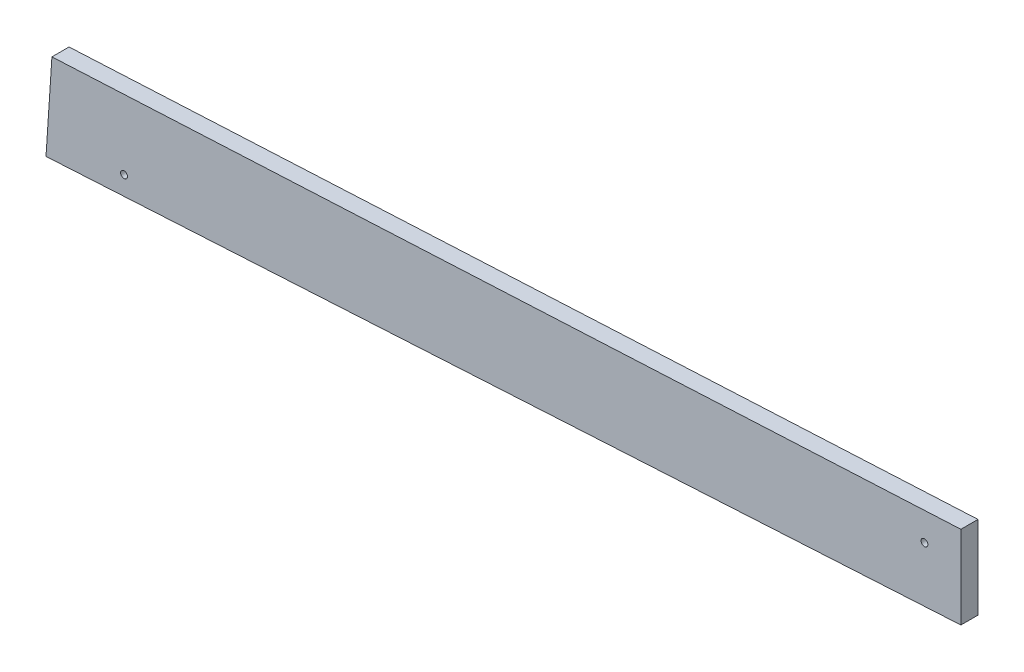
ISO-10303-21;
HEADER;
FILE_DESCRIPTION(('STEP AP214'),'2;1');
FILE_NAME('part.step','',(''),(''),'','','');
FILE_SCHEMA(('AUTOMOTIVE_DESIGN { 1 0 10303 214 1 1 1 1 }'));
ENDSEC;
DATA;
#1=APPLICATION_CONTEXT('core data for automotive mechanical design processes');
#2=APPLICATION_PROTOCOL_DEFINITION('international standard','automotive_design',2000,#1);
#3=PRODUCT_CONTEXT('',#1,'mechanical');
#4=PRODUCT('Part','Part','',(#3));
#5=PRODUCT_RELATED_PRODUCT_CATEGORY('part','',(#4));
#6=PRODUCT_DEFINITION_FORMATION('','',#4);
#7=PRODUCT_DEFINITION_CONTEXT('part definition',#1,'design');
#8=PRODUCT_DEFINITION('design','',#6,#7);
#9=PRODUCT_DEFINITION_SHAPE('','',#8);
#10=(LENGTH_UNIT() NAMED_UNIT(*) SI_UNIT(.MILLI.,.METRE.));
#11=(NAMED_UNIT(*) PLANE_ANGLE_UNIT() SI_UNIT($,.RADIAN.));
#12=(NAMED_UNIT(*) SI_UNIT($,.STERADIAN.) SOLID_ANGLE_UNIT());
#13=UNCERTAINTY_MEASURE_WITH_UNIT(LENGTH_MEASURE(1.E-05),#10,'distance_accuracy_value','');
#14=(GEOMETRIC_REPRESENTATION_CONTEXT(3) GLOBAL_UNCERTAINTY_ASSIGNED_CONTEXT((#13)) GLOBAL_UNIT_ASSIGNED_CONTEXT((#10,
#11,#12)) REPRESENTATION_CONTEXT('',''));
#15=CARTESIAN_POINT('',(0.,0.,0.));
#16=DIRECTION('',(0.,0.,1.));
#17=DIRECTION('',(1.,0.,0.));
#18=AXIS2_PLACEMENT_3D('',#15,#16,#17);
#19=CARTESIAN_POINT('',(-1.5875,0.,-3.175));
#20=DIRECTION('',(1.,0.,0.));
#21=DIRECTION('',(0.,1.,0.));
#22=AXIS2_PLACEMENT_3D('',#19,#20,#21);
#23=PLANE('',#22);
#24=DIRECTION('',(0.,1.,0.));
#25=VECTOR('',#24,1.);
#26=CARTESIAN_POINT('',(-1.5875,0.,0.));
#27=LINE('',#26,#25);
#28=CARTESIAN_POINT('',(-1.5875,113.111399163634,0.));
#29=VERTEX_POINT('',#28);
#30=CARTESIAN_POINT('',(-1.5875,128.50423360122,0.));
#31=VERTEX_POINT('',#30);
#32=EDGE_CURVE('E109',#29,#31,#27,.T.);
#33=ORIENTED_EDGE('',*,*,#32,.F.);
#34=DIRECTION('',(0.,0.,1.));
#35=VECTOR('',#34,1.);
#36=CARTESIAN_POINT('',(-1.5875,113.111399163634,-3.175));
#37=LINE('',#36,#35);
#38=CARTESIAN_POINT('',(-1.5875,113.111399163634,-3.175));
#39=VERTEX_POINT('',#38);
#40=EDGE_CURVE('E11',#39,#29,#37,.T.);
#41=ORIENTED_EDGE('',*,*,#40,.F.);
#42=DIRECTION('',(0.,1.,0.));
#43=VECTOR('',#42,1.);
#44=CARTESIAN_POINT('',(-1.5875,0.,-3.175));
#45=LINE('',#44,#43);
#46=CARTESIAN_POINT('',(-1.5875,128.50423360122,-3.175));
#47=VERTEX_POINT('',#46);
#48=EDGE_CURVE('E96',#39,#47,#45,.T.);
#49=ORIENTED_EDGE('',*,*,#48,.T.);
#50=DIRECTION('',(0.,0.,1.));
#51=VECTOR('',#50,1.);
#52=CARTESIAN_POINT('',(-1.5875,128.50423360122,-3.175));
#53=LINE('',#52,#51);
#54=EDGE_CURVE('E39',#47,#31,#53,.T.);
#55=ORIENTED_EDGE('',*,*,#54,.T.);
#56=EDGE_LOOP('',(#33,#41,#49,#55));
#57=FACE_BOUND('',#56,.T.);
#58=ADVANCED_FACE('F35',(#57),#23,.T.);
#59=CARTESIAN_POINT('',(-6.36809609619887,112.841611316913,-3.175));
#60=DIRECTION('',(-0.056344283446455,0.99841139903494,0.));
#61=DIRECTION('',(-0.99841139903494,-0.056344283446455,0.));
#62=AXIS2_PLACEMENT_3D('',#59,#60,#61);
#63=PLANE('',#62);
#64=DIRECTION('',(-0.99841139903494,-0.056344283446455,0.));
#65=VECTOR('',#64,1.);
#66=CARTESIAN_POINT('',(-6.36809609619887,112.841611316913,0.));
#67=LINE('',#66,#65);
#68=CARTESIAN_POINT('',(-171.411810426473,103.527545161149,0.));
#69=VERTEX_POINT('',#68);
#70=EDGE_CURVE('E115',#29,#69,#67,.T.);
#71=ORIENTED_EDGE('',*,*,#70,.T.);
#72=DIRECTION('',(0.,0.,1.));
#73=VECTOR('',#72,1.);
#74=CARTESIAN_POINT('',(-171.411810426473,103.527545161149,-3.175));
#75=LINE('',#74,#73);
#76=CARTESIAN_POINT('',(-171.411810426473,103.527545161149,-3.175));
#77=VERTEX_POINT('',#76);
#78=EDGE_CURVE('E45',#77,#69,#75,.T.);
#79=ORIENTED_EDGE('',*,*,#78,.F.);
#80=DIRECTION('',(-0.99841139903494,-0.056344283446455,0.));
#81=VECTOR('',#80,1.);
#82=CARTESIAN_POINT('',(-6.36809609619887,112.841611316913,-3.175));
#83=LINE('',#82,#81);
#84=EDGE_CURVE('E89',#39,#77,#83,.T.);
#85=ORIENTED_EDGE('',*,*,#84,.F.);
#86=ORIENTED_EDGE('',*,*,#40,.T.);
#87=EDGE_LOOP('',(#71,#79,#85,#86));
#88=FACE_BOUND('',#87,.T.);
#89=ADVANCED_FACE('F118',(#88),#63,.F.);
#90=CARTESIAN_POINT('',(-177.501750398789,11.7823625646204,-3.175));
#91=DIRECTION('',(0.997804177636263,-0.0662330966482885,0.));
#92=DIRECTION('',(0.0662330966482885,0.997804177636263,0.));
#93=AXIS2_PLACEMENT_3D('',#90,#91,#92);
#94=PLANE('',#93);
#95=DIRECTION('',(0.0662330966482885,0.997804177636263,0.));
#96=VECTOR('',#95,1.);
#97=CARTESIAN_POINT('',(-177.501750398789,11.7823625646204,0.));
#98=LINE('',#97,#96);
#99=CARTESIAN_POINT('',(-170.312713846563,120.085477895044,0.));
#100=VERTEX_POINT('',#99);
#101=EDGE_CURVE('E70',#69,#100,#98,.T.);
#102=ORIENTED_EDGE('',*,*,#101,.T.);
#103=DIRECTION('',(0.,0.,1.));
#104=VECTOR('',#103,1.);
#105=CARTESIAN_POINT('',(-170.312713846563,120.085477895044,-3.175));
#106=LINE('',#105,#104);
#107=CARTESIAN_POINT('',(-170.312713846563,120.085477895044,-3.175));
#108=VERTEX_POINT('',#107);
#109=EDGE_CURVE('E93',#108,#100,#106,.T.);
#110=ORIENTED_EDGE('',*,*,#109,.F.);
#111=DIRECTION('',(0.0662330966482885,0.997804177636263,0.));
#112=VECTOR('',#111,1.);
#113=CARTESIAN_POINT('',(-177.501750398789,11.7823625646204,-3.175));
#114=LINE('',#113,#112);
#115=EDGE_CURVE('E84',#77,#108,#114,.T.);
#116=ORIENTED_EDGE('',*,*,#115,.F.);
#117=ORIENTED_EDGE('',*,*,#78,.T.);
#118=EDGE_LOOP('',(#102,#110,#116,#117));
#119=FACE_BOUND('',#118,.T.);
#120=ADVANCED_FACE('F94',(#119),#94,.F.);
#121=CARTESIAN_POINT('',(-8.34662321607027,122.968890992581,-3.175));
#122=DIRECTION('',(0.,0.,1.));
#123=DIRECTION('',(1.,0.,0.));
#124=AXIS2_PLACEMENT_3D('',#121,#122,#123);
#125=CYLINDRICAL_SURFACE('',#124,0.635000000000001);
#126=CARTESIAN_POINT('',(-8.34662321607027,122.968890992581,-3.175));
#127=DIRECTION('',(0.,0.,1.));
#128=DIRECTION('',(1.,0.,0.));
#129=AXIS2_PLACEMENT_3D('',#126,#127,#128);
#130=CIRCLE('',#129,0.635000000000001);
#131=CARTESIAN_POINT('',(-7.71162321607027,122.968890992581,-3.175));
#132=VERTEX_POINT('',#131);
#133=EDGE_CURVE('E98',#132,#132,#130,.T.);
#134=ORIENTED_EDGE('',*,*,#133,.F.);
#135=EDGE_LOOP('',(#134));
#136=FACE_BOUND('',#135,.T.);
#137=CARTESIAN_POINT('',(-8.34662321607027,122.968890992581,0.));
#138=DIRECTION('',(0.,0.,1.));
#139=DIRECTION('',(1.,0.,0.));
#140=AXIS2_PLACEMENT_3D('',#137,#138,#139);
#141=CIRCLE('',#140,0.635000000000001);
#142=CARTESIAN_POINT('',(-7.71162321607027,122.968890992581,0.));
#143=VERTEX_POINT('',#142);
#144=EDGE_CURVE('E106',#143,#143,#141,.T.);
#145=ORIENTED_EDGE('',*,*,#144,.T.);
#146=EDGE_LOOP('',(#145));
#147=FACE_BOUND('',#146,.T.);
#148=ADVANCED_FACE('F128',(#136,#147),#125,.F.);
#149=CARTESIAN_POINT('',(-156.924194118531,107.841267282993,-3.175));
#150=DIRECTION('',(0.,0.,1.));
#151=DIRECTION('',(1.,0.,0.));
#152=AXIS2_PLACEMENT_3D('',#149,#150,#151);
#153=CYLINDRICAL_SURFACE('',#152,0.63499999999999);
#154=CARTESIAN_POINT('',(-156.924194118531,107.841267282993,-3.175));
#155=DIRECTION('',(0.,0.,1.));
#156=DIRECTION('',(1.,0.,0.));
#157=AXIS2_PLACEMENT_3D('',#154,#155,#156);
#158=CIRCLE('',#157,0.63499999999999);
#159=CARTESIAN_POINT('',(-156.289194118531,107.841267282993,-3.175));
#160=VERTEX_POINT('',#159);
#161=EDGE_CURVE('E116',#160,#160,#158,.T.);
#162=ORIENTED_EDGE('',*,*,#161,.F.);
#163=EDGE_LOOP('',(#162));
#164=FACE_BOUND('',#163,.T.);
#165=CARTESIAN_POINT('',(-156.924194118531,107.841267282993,0.));
#166=DIRECTION('',(0.,0.,1.));
#167=DIRECTION('',(1.,0.,0.));
#168=AXIS2_PLACEMENT_3D('',#165,#166,#167);
#169=CIRCLE('',#168,0.63499999999999);
#170=CARTESIAN_POINT('',(-156.289194118531,107.841267282993,0.));
#171=VERTEX_POINT('',#170);
#172=EDGE_CURVE('E103',#171,#171,#169,.T.);
#173=ORIENTED_EDGE('',*,*,#172,.T.);
#174=EDGE_LOOP('',(#173));
#175=FACE_BOUND('',#174,.T.);
#176=ADVANCED_FACE('F37',(#164,#175),#153,.F.);
#177=CARTESIAN_POINT('',(-6.39989843988132,128.264112958297,-3.175));
#178=DIRECTION('',(-0.0498342554968085,0.998757501588388,0.));
#179=DIRECTION('',(-0.998757501588388,-0.0498342554968085,0.));
#180=AXIS2_PLACEMENT_3D('',#177,#178,#179);
#181=PLANE('',#180);
#182=DIRECTION('',(-0.998757501588388,-0.0498342554968085,0.));
#183=VECTOR('',#182,1.);
#184=CARTESIAN_POINT('',(-6.39989843988132,128.264112958297,0.));
#185=LINE('',#184,#183);
#186=EDGE_CURVE('E112',#31,#100,#185,.T.);
#187=ORIENTED_EDGE('',*,*,#186,.F.);
#188=ORIENTED_EDGE('',*,*,#54,.F.);
#189=DIRECTION('',(-0.998757501588388,-0.0498342554968085,0.));
#190=VECTOR('',#189,1.);
#191=CARTESIAN_POINT('',(-6.39989843988132,128.264112958297,-3.175));
#192=LINE('',#191,#190);
#193=EDGE_CURVE('E88',#47,#108,#192,.T.);
#194=ORIENTED_EDGE('',*,*,#193,.T.);
#195=ORIENTED_EDGE('',*,*,#109,.T.);
#196=EDGE_LOOP('',(#187,#188,#194,#195));
#197=FACE_BOUND('',#196,.T.);
#198=ADVANCED_FACE('F95',(#197),#181,.T.);
#199=CARTESIAN_POINT('',(0.,0.,-3.175));
#200=DIRECTION('',(0.,0.,1.));
#201=DIRECTION('',(1.,0.,0.));
#202=AXIS2_PLACEMENT_3D('',#199,#200,#201);
#203=PLANE('',#202);
#204=ORIENTED_EDGE('',*,*,#161,.T.);
#205=EDGE_LOOP('',(#204));
#206=FACE_BOUND('',#205,.T.);
#207=ORIENTED_EDGE('',*,*,#133,.T.);
#208=EDGE_LOOP('',(#207));
#209=FACE_BOUND('',#208,.T.);
#210=ORIENTED_EDGE('',*,*,#48,.F.);
#211=ORIENTED_EDGE('',*,*,#84,.T.);
#212=ORIENTED_EDGE('',*,*,#115,.T.);
#213=ORIENTED_EDGE('',*,*,#193,.F.);
#214=EDGE_LOOP('',(#210,#211,#212,#213));
#215=FACE_BOUND('',#214,.T.);
#216=ADVANCED_FACE('F87',(#206,#209,#215),#203,.F.);
#217=CARTESIAN_POINT('',(0.,0.,0.));
#218=DIRECTION('',(0.,0.,1.));
#219=DIRECTION('',(1.,0.,0.));
#220=AXIS2_PLACEMENT_3D('',#217,#218,#219);
#221=PLANE('',#220);
#222=ORIENTED_EDGE('',*,*,#172,.F.);
#223=EDGE_LOOP('',(#222));
#224=FACE_BOUND('',#223,.T.);
#225=ORIENTED_EDGE('',*,*,#144,.F.);
#226=EDGE_LOOP('',(#225));
#227=FACE_BOUND('',#226,.T.);
#228=ORIENTED_EDGE('',*,*,#32,.T.);
#229=ORIENTED_EDGE('',*,*,#186,.T.);
#230=ORIENTED_EDGE('',*,*,#101,.F.);
#231=ORIENTED_EDGE('',*,*,#70,.F.);
#232=EDGE_LOOP('',(#228,#229,#230,#231));
#233=FACE_BOUND('',#232,.T.);
#234=ADVANCED_FACE('F119',(#224,#227,#233),#221,.T.);
#235=CLOSED_SHELL('',(#58,#89,#120,#148,#176,#198,#216,#234));
#236=MANIFOLD_SOLID_BREP('B2',#235);
#237=ADVANCED_BREP_SHAPE_REPRESENTATION('',(#18,#236),#14);
#238=SHAPE_DEFINITION_REPRESENTATION(#9,#237);
ENDSEC;
END-ISO-10303-21;
